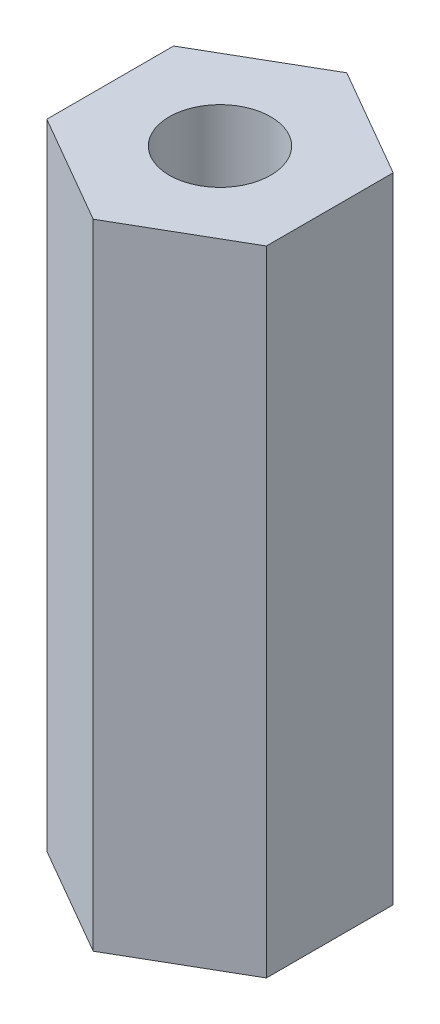
ISO-10303-21;
HEADER;
FILE_DESCRIPTION(('STEP AP214'),'2;1');
FILE_NAME('part.step','',(''),(''),'','','');
FILE_SCHEMA(('AUTOMOTIVE_DESIGN { 1 0 10303 214 1 1 1 1 }'));
ENDSEC;
DATA;
#1=APPLICATION_CONTEXT('core data for automotive mechanical design processes');
#2=APPLICATION_PROTOCOL_DEFINITION('international standard','automotive_design',2000,#1);
#3=PRODUCT_CONTEXT('',#1,'mechanical');
#4=PRODUCT('Part','Part','',(#3));
#5=PRODUCT_RELATED_PRODUCT_CATEGORY('part','',(#4));
#6=PRODUCT_DEFINITION_FORMATION('','',#4);
#7=PRODUCT_DEFINITION_CONTEXT('part definition',#1,'design');
#8=PRODUCT_DEFINITION('design','',#6,#7);
#9=PRODUCT_DEFINITION_SHAPE('','',#8);
#10=(LENGTH_UNIT() NAMED_UNIT(*) SI_UNIT(.MILLI.,.METRE.));
#11=(NAMED_UNIT(*) PLANE_ANGLE_UNIT() SI_UNIT($,.RADIAN.));
#12=(NAMED_UNIT(*) SI_UNIT($,.STERADIAN.) SOLID_ANGLE_UNIT());
#13=UNCERTAINTY_MEASURE_WITH_UNIT(LENGTH_MEASURE(1.E-05),#10,'distance_accuracy_value','');
#14=(GEOMETRIC_REPRESENTATION_CONTEXT(3) GLOBAL_UNCERTAINTY_ASSIGNED_CONTEXT((#13)) GLOBAL_UNIT_ASSIGNED_CONTEXT((#10,
#11,#12)) REPRESENTATION_CONTEXT('',''));
#15=CARTESIAN_POINT('',(0.,0.,0.));
#16=DIRECTION('',(0.,0.,1.));
#17=DIRECTION('',(1.,0.,0.));
#18=AXIS2_PLACEMENT_3D('',#15,#16,#17);
#19=CARTESIAN_POINT('',(0.,10.,1.99999999999999));
#20=DIRECTION('',(-0.500000000000002,0.,-0.866025403784438));
#21=DIRECTION('',(-0.866025403784438,0.,0.500000000000002));
#22=AXIS2_PLACEMENT_3D('',#19,#20,#21);
#23=PLANE('',#22);
#24=DIRECTION('',(0.866025403784438,0.,-0.500000000000002));
#25=VECTOR('',#24,1.);
#26=CARTESIAN_POINT('',(0.,0.,1.99999999999999));
#27=LINE('',#26,#25);
#28=CARTESIAN_POINT('',(0.,0.,1.99999999999999));
#29=VERTEX_POINT('',#28);
#30=CARTESIAN_POINT('',(1.73205080756888,0.,0.99999999999999));
#31=VERTEX_POINT('',#30);
#32=EDGE_CURVE('E119',#29,#31,#27,.T.);
#33=ORIENTED_EDGE('',*,*,#32,.T.);
#34=DIRECTION('',(0.,-1.,0.));
#35=VECTOR('',#34,1.);
#36=CARTESIAN_POINT('',(1.73205080756888,10.,0.99999999999999));
#37=LINE('',#36,#35);
#38=CARTESIAN_POINT('',(1.73205080756888,10.,0.99999999999999));
#39=VERTEX_POINT('',#38);
#40=EDGE_CURVE('E11',#39,#31,#37,.T.);
#41=ORIENTED_EDGE('',*,*,#40,.F.);
#42=DIRECTION('',(0.866025403784438,0.,-0.500000000000002));
#43=VECTOR('',#42,1.);
#44=CARTESIAN_POINT('',(0.,10.,1.99999999999999));
#45=LINE('',#44,#43);
#46=CARTESIAN_POINT('',(0.,10.,1.99999999999999));
#47=VERTEX_POINT('',#46);
#48=EDGE_CURVE('E130',#47,#39,#45,.T.);
#49=ORIENTED_EDGE('',*,*,#48,.F.);
#50=DIRECTION('',(0.,-1.,0.));
#51=VECTOR('',#50,1.);
#52=CARTESIAN_POINT('',(0.,10.,1.99999999999999));
#53=LINE('',#52,#51);
#54=EDGE_CURVE('E115',#47,#29,#53,.T.);
#55=ORIENTED_EDGE('',*,*,#54,.T.);
#56=EDGE_LOOP('',(#33,#41,#49,#55));
#57=FACE_BOUND('',#56,.T.);
#58=ADVANCED_FACE('F35',(#57),#23,.F.);
#59=CARTESIAN_POINT('',(1.73205080756888,10.,0.99999999999999));
#60=DIRECTION('',(-1.,0.,0.));
#61=DIRECTION('',(0.,0.,1.));
#62=AXIS2_PLACEMENT_3D('',#59,#60,#61);
#63=PLANE('',#62);
#64=DIRECTION('',(0.,0.,-1.));
#65=VECTOR('',#64,1.);
#66=CARTESIAN_POINT('',(1.73205080756888,0.,0.99999999999999));
#67=LINE('',#66,#65);
#68=CARTESIAN_POINT('',(1.73205080756887,0.,-1.));
#69=VERTEX_POINT('',#68);
#70=EDGE_CURVE('E122',#31,#69,#67,.T.);
#71=ORIENTED_EDGE('',*,*,#70,.T.);
#72=DIRECTION('',(0.,-1.,0.));
#73=VECTOR('',#72,1.);
#74=CARTESIAN_POINT('',(1.73205080756887,10.,-1.));
#75=LINE('',#74,#73);
#76=CARTESIAN_POINT('',(1.73205080756887,10.,-1.));
#77=VERTEX_POINT('',#76);
#78=EDGE_CURVE('E43',#77,#69,#75,.T.);
#79=ORIENTED_EDGE('',*,*,#78,.F.);
#80=DIRECTION('',(0.,0.,-1.));
#81=VECTOR('',#80,1.);
#82=CARTESIAN_POINT('',(1.73205080756888,10.,0.99999999999999));
#83=LINE('',#82,#81);
#84=EDGE_CURVE('E88',#39,#77,#83,.T.);
#85=ORIENTED_EDGE('',*,*,#84,.F.);
#86=ORIENTED_EDGE('',*,*,#40,.T.);
#87=EDGE_LOOP('',(#71,#79,#85,#86));
#88=FACE_BOUND('',#87,.T.);
#89=ADVANCED_FACE('F155',(#88),#63,.F.);
#90=CARTESIAN_POINT('',(1.73205080756887,10.,-1.));
#91=DIRECTION('',(-0.499999999999999,0.,0.866025403784439));
#92=DIRECTION('',(0.866025403784439,0.,0.499999999999999));
#93=AXIS2_PLACEMENT_3D('',#90,#91,#92);
#94=PLANE('',#93);
#95=DIRECTION('',(-0.866025403784439,0.,-0.499999999999999));
#96=VECTOR('',#95,1.);
#97=CARTESIAN_POINT('',(1.73205080756887,0.,-1.));
#98=LINE('',#97,#96);
#99=CARTESIAN_POINT('',(0.,0.,-2.));
#100=VERTEX_POINT('',#99);
#101=EDGE_CURVE('E125',#69,#100,#98,.T.);
#102=ORIENTED_EDGE('',*,*,#101,.T.);
#103=DIRECTION('',(0.,-1.,0.));
#104=VECTOR('',#103,1.);
#105=CARTESIAN_POINT('',(0.,10.,-2.));
#106=LINE('',#105,#104);
#107=CARTESIAN_POINT('',(0.,10.,-2.));
#108=VERTEX_POINT('',#107);
#109=EDGE_CURVE('E110',#108,#100,#106,.T.);
#110=ORIENTED_EDGE('',*,*,#109,.F.);
#111=DIRECTION('',(-0.866025403784439,0.,-0.499999999999999));
#112=VECTOR('',#111,1.);
#113=CARTESIAN_POINT('',(1.73205080756887,10.,-1.));
#114=LINE('',#113,#112);
#115=EDGE_CURVE('E101',#77,#108,#114,.T.);
#116=ORIENTED_EDGE('',*,*,#115,.F.);
#117=ORIENTED_EDGE('',*,*,#78,.T.);
#118=EDGE_LOOP('',(#102,#110,#116,#117));
#119=FACE_BOUND('',#118,.T.);
#120=ADVANCED_FACE('F136',(#119),#94,.F.);
#121=CARTESIAN_POINT('',(0.,10.,-2.));
#122=DIRECTION('',(0.500000000000001,0.,0.866025403784438));
#123=DIRECTION('',(0.866025403784438,0.,-0.500000000000001));
#124=AXIS2_PLACEMENT_3D('',#121,#122,#123);
#125=PLANE('',#124);
#126=DIRECTION('',(-0.866025403784438,0.,0.500000000000001));
#127=VECTOR('',#126,1.);
#128=CARTESIAN_POINT('',(0.,0.,-2.));
#129=LINE('',#128,#127);
#130=CARTESIAN_POINT('',(-1.73205080756888,0.,-0.999999999999997));
#131=VERTEX_POINT('',#130);
#132=EDGE_CURVE('E109',#100,#131,#129,.T.);
#133=ORIENTED_EDGE('',*,*,#132,.T.);
#134=DIRECTION('',(0.,-1.,0.));
#135=VECTOR('',#134,1.);
#136=CARTESIAN_POINT('',(-1.73205080756888,10.,-0.999999999999997));
#137=LINE('',#136,#135);
#138=CARTESIAN_POINT('',(-1.73205080756888,10.,-0.999999999999997));
#139=VERTEX_POINT('',#138);
#140=EDGE_CURVE('E106',#139,#131,#137,.T.);
#141=ORIENTED_EDGE('',*,*,#140,.F.);
#142=DIRECTION('',(-0.866025403784438,0.,0.500000000000001));
#143=VECTOR('',#142,1.);
#144=CARTESIAN_POINT('',(0.,10.,-2.));
#145=LINE('',#144,#143);
#146=EDGE_CURVE('E95',#108,#139,#145,.T.);
#147=ORIENTED_EDGE('',*,*,#146,.F.);
#148=ORIENTED_EDGE('',*,*,#109,.T.);
#149=EDGE_LOOP('',(#133,#141,#147,#148));
#150=FACE_BOUND('',#149,.T.);
#151=ADVANCED_FACE('F107',(#150),#125,.F.);
#152=CARTESIAN_POINT('',(-1.73205080756888,10.,-0.999999999999997));
#153=DIRECTION('',(1.,0.,0.));
#154=DIRECTION('',(0.,0.,-1.));
#155=AXIS2_PLACEMENT_3D('',#152,#153,#154);
#156=PLANE('',#155);
#157=DIRECTION('',(0.,0.,1.));
#158=VECTOR('',#157,1.);
#159=CARTESIAN_POINT('',(-1.73205080756888,0.,-0.999999999999997));
#160=LINE('',#159,#158);
#161=CARTESIAN_POINT('',(-1.73205080756887,0.,0.999999999999997));
#162=VERTEX_POINT('',#161);
#163=EDGE_CURVE('E74',#131,#162,#160,.T.);
#164=ORIENTED_EDGE('',*,*,#163,.T.);
#165=DIRECTION('',(0.,-1.,0.));
#166=VECTOR('',#165,1.);
#167=CARTESIAN_POINT('',(-1.73205080756887,10.,0.999999999999997));
#168=LINE('',#167,#166);
#169=CARTESIAN_POINT('',(-1.73205080756887,10.,0.999999999999997));
#170=VERTEX_POINT('',#169);
#171=EDGE_CURVE('E111',#170,#162,#168,.T.);
#172=ORIENTED_EDGE('',*,*,#171,.F.);
#173=DIRECTION('',(0.,0.,1.));
#174=VECTOR('',#173,1.);
#175=CARTESIAN_POINT('',(-1.73205080756888,10.,-0.999999999999997));
#176=LINE('',#175,#174);
#177=EDGE_CURVE('E99',#139,#170,#176,.T.);
#178=ORIENTED_EDGE('',*,*,#177,.F.);
#179=ORIENTED_EDGE('',*,*,#140,.T.);
#180=EDGE_LOOP('',(#164,#172,#178,#179));
#181=FACE_BOUND('',#180,.T.);
#182=ADVANCED_FACE('F113',(#181),#156,.F.);
#183=CARTESIAN_POINT('',(-1.73205080756887,10.,0.999999999999997));
#184=DIRECTION('',(0.5,0.,-0.866025403784438));
#185=DIRECTION('',(-0.866025403784439,0.,-0.5));
#186=AXIS2_PLACEMENT_3D('',#183,#184,#185);
#187=PLANE('',#186);
#188=DIRECTION('',(0.866025403784438,0.,0.5));
#189=VECTOR('',#188,1.);
#190=CARTESIAN_POINT('',(-1.73205080756887,0.,0.999999999999997));
#191=LINE('',#190,#189);
#192=EDGE_CURVE('E80',#162,#29,#191,.T.);
#193=ORIENTED_EDGE('',*,*,#192,.T.);
#194=ORIENTED_EDGE('',*,*,#54,.F.);
#195=DIRECTION('',(0.866025403784438,0.,0.5));
#196=VECTOR('',#195,1.);
#197=CARTESIAN_POINT('',(-1.73205080756887,10.,0.999999999999997));
#198=LINE('',#197,#196);
#199=EDGE_CURVE('E51',#170,#47,#198,.T.);
#200=ORIENTED_EDGE('',*,*,#199,.F.);
#201=ORIENTED_EDGE('',*,*,#171,.T.);
#202=EDGE_LOOP('',(#193,#194,#200,#201));
#203=FACE_BOUND('',#202,.T.);
#204=ADVANCED_FACE('F143',(#203),#187,.F.);
#205=CARTESIAN_POINT('',(0.,10.,0.));
#206=DIRECTION('',(0.,1.,0.));
#207=DIRECTION('',(0.,0.,1.));
#208=AXIS2_PLACEMENT_3D('',#205,#206,#207);
#209=PLANE('',#208);
#210=CARTESIAN_POINT('',(0.,10.,0.));
#211=DIRECTION('',(0.,1.,0.));
#212=DIRECTION('',(0.,0.,1.));
#213=AXIS2_PLACEMENT_3D('',#210,#211,#212);
#214=CIRCLE('',#213,0.799999999999988);
#215=CARTESIAN_POINT('',(0.,10.,0.799999999999988));
#216=VERTEX_POINT('',#215);
#217=EDGE_CURVE('E212',#216,#216,#214,.T.);
#218=ORIENTED_EDGE('',*,*,#217,.F.);
#219=EDGE_LOOP('',(#218));
#220=FACE_BOUND('',#219,.T.);
#221=ORIENTED_EDGE('',*,*,#48,.T.);
#222=ORIENTED_EDGE('',*,*,#84,.T.);
#223=ORIENTED_EDGE('',*,*,#115,.T.);
#224=ORIENTED_EDGE('',*,*,#146,.T.);
#225=ORIENTED_EDGE('',*,*,#177,.T.);
#226=ORIENTED_EDGE('',*,*,#199,.T.);
#227=EDGE_LOOP('',(#221,#222,#223,#224,#225,#226));
#228=FACE_BOUND('',#227,.T.);
#229=ADVANCED_FACE('F97',(#220,#228),#209,.T.);
#230=CARTESIAN_POINT('',(0.,0.,0.));
#231=DIRECTION('',(0.,1.,0.));
#232=DIRECTION('',(0.,0.,1.));
#233=AXIS2_PLACEMENT_3D('',#230,#231,#232);
#234=PLANE('',#233);
#235=CARTESIAN_POINT('',(0.,0.,0.));
#236=DIRECTION('',(0.,1.,0.));
#237=DIRECTION('',(0.,0.,1.));
#238=AXIS2_PLACEMENT_3D('',#235,#236,#237);
#239=CIRCLE('',#238,0.799999999999997);
#240=CARTESIAN_POINT('',(0.,0.,0.799999999999997));
#241=VERTEX_POINT('',#240);
#242=EDGE_CURVE('E123',#241,#241,#239,.T.);
#243=ORIENTED_EDGE('',*,*,#242,.T.);
#244=EDGE_LOOP('',(#243));
#245=FACE_BOUND('',#244,.T.);
#246=ORIENTED_EDGE('',*,*,#32,.F.);
#247=ORIENTED_EDGE('',*,*,#192,.F.);
#248=ORIENTED_EDGE('',*,*,#163,.F.);
#249=ORIENTED_EDGE('',*,*,#132,.F.);
#250=ORIENTED_EDGE('',*,*,#101,.F.);
#251=ORIENTED_EDGE('',*,*,#70,.F.);
#252=EDGE_LOOP('',(#246,#247,#248,#249,#250,#251));
#253=FACE_BOUND('',#252,.T.);
#254=ADVANCED_FACE('F139',(#245,#253),#234,.F.);
#255=CARTESIAN_POINT('',(0.,10.,0.));
#256=DIRECTION('',(0.,1.,0.));
#257=DIRECTION('',(0.,0.,1.));
#258=AXIS2_PLACEMENT_3D('',#255,#256,#257);
#259=CYLINDRICAL_SURFACE('',#258,0.799999999999993);
#260=ORIENTED_EDGE('',*,*,#242,.F.);
#261=EDGE_LOOP('',(#260));
#262=FACE_BOUND('',#261,.T.);
#263=ORIENTED_EDGE('',*,*,#217,.T.);
#264=EDGE_LOOP('',(#263));
#265=FACE_BOUND('',#264,.T.);
#266=ADVANCED_FACE('F192',(#262,#265),#259,.F.);
#267=CLOSED_SHELL('',(#58,#89,#120,#151,#182,#204,#229,#254,#266));
#268=MANIFOLD_SOLID_BREP('B2',#267);
#269=ADVANCED_BREP_SHAPE_REPRESENTATION('',(#18,#268),#14);
#270=SHAPE_DEFINITION_REPRESENTATION(#9,#269);
ENDSEC;
END-ISO-10303-21;
